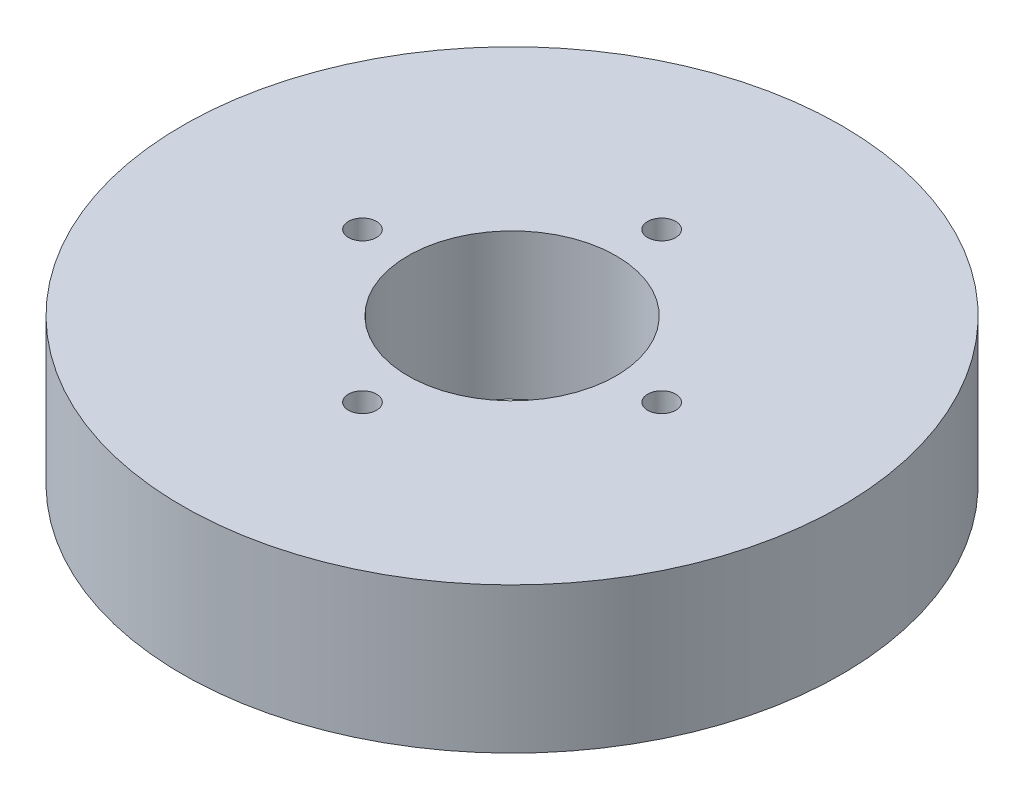
ISO-10303-21;
HEADER;
FILE_DESCRIPTION(('STEP AP214'),'2;1');
FILE_NAME('part.step','',(''),(''),'','','');
FILE_SCHEMA(('AUTOMOTIVE_DESIGN { 1 0 10303 214 1 1 1 1 }'));
ENDSEC;
DATA;
#1=APPLICATION_CONTEXT('core data for automotive mechanical design processes');
#2=APPLICATION_PROTOCOL_DEFINITION('international standard','automotive_design',2000,#1);
#3=PRODUCT_CONTEXT('',#1,'mechanical');
#4=PRODUCT('Part','Part','',(#3));
#5=PRODUCT_RELATED_PRODUCT_CATEGORY('part','',(#4));
#6=PRODUCT_DEFINITION_FORMATION('','',#4);
#7=PRODUCT_DEFINITION_CONTEXT('part definition',#1,'design');
#8=PRODUCT_DEFINITION('design','',#6,#7);
#9=PRODUCT_DEFINITION_SHAPE('','',#8);
#10=(LENGTH_UNIT() NAMED_UNIT(*) SI_UNIT(.MILLI.,.METRE.));
#11=(NAMED_UNIT(*) PLANE_ANGLE_UNIT() SI_UNIT($,.RADIAN.));
#12=(NAMED_UNIT(*) SI_UNIT($,.STERADIAN.) SOLID_ANGLE_UNIT());
#13=UNCERTAINTY_MEASURE_WITH_UNIT(LENGTH_MEASURE(1.E-05),#10,'distance_accuracy_value','');
#14=(GEOMETRIC_REPRESENTATION_CONTEXT(3) GLOBAL_UNCERTAINTY_ASSIGNED_CONTEXT((#13)) GLOBAL_UNIT_ASSIGNED_CONTEXT((#10,
#11,#12)) REPRESENTATION_CONTEXT('',''));
#15=CARTESIAN_POINT('',(0.,0.,0.));
#16=DIRECTION('',(0.,0.,1.));
#17=DIRECTION('',(1.,0.,0.));
#18=AXIS2_PLACEMENT_3D('',#15,#16,#17);
#19=CARTESIAN_POINT('',(0.,21.,0.));
#20=DIRECTION('',(0.,-1.,0.));
#21=DIRECTION('',(0.,0.,-1.));
#22=AXIS2_PLACEMENT_3D('',#19,#20,#21);
#23=CYLINDRICAL_SURFACE('',#22,47.5);
#24=CARTESIAN_POINT('',(0.,21.,0.));
#25=DIRECTION('',(0.,1.,0.));
#26=DIRECTION('',(0.,0.,1.));
#27=AXIS2_PLACEMENT_3D('',#24,#25,#26);
#28=CIRCLE('',#27,47.5);
#29=CARTESIAN_POINT('',(0.,21.,-47.5));
#30=VERTEX_POINT('',#29);
#31=EDGE_CURVE('E10',#30,#30,#28,.T.);
#32=CARTESIAN_POINT('',(0.,0.,0.));
#33=DIRECTION('',(0.,1.,0.));
#34=DIRECTION('',(0.,0.,1.));
#35=AXIS2_PLACEMENT_3D('',#32,#33,#34);
#36=CIRCLE('',#35,47.5);
#37=CARTESIAN_POINT('',(0.,0.,-47.5));
#38=VERTEX_POINT('',#37);
#39=EDGE_CURVE('E37',#38,#38,#36,.T.);
#40=CARTESIAN_POINT('',(0.,21.,-47.5));
#41=CARTESIAN_POINT('',(0.,20.78125,-47.5));
#42=CARTESIAN_POINT('',(0.,20.5625,-47.5));
#43=CARTESIAN_POINT('',(0.,20.125,-47.5));
#44=CARTESIAN_POINT('',(0.,19.90625,-47.5));
#45=CARTESIAN_POINT('',(0.,19.46875,-47.5));
#46=CARTESIAN_POINT('',(0.,19.25,-47.5));
#47=CARTESIAN_POINT('',(0.,18.8125,-47.5));
#48=CARTESIAN_POINT('',(0.,18.59375,-47.5));
#49=CARTESIAN_POINT('',(0.,18.15625,-47.5));
#50=CARTESIAN_POINT('',(0.,17.9375,-47.5));
#51=CARTESIAN_POINT('',(0.,17.5,-47.5));
#52=CARTESIAN_POINT('',(0.,17.28125,-47.5));
#53=CARTESIAN_POINT('',(0.,16.84375,-47.5));
#54=CARTESIAN_POINT('',(0.,16.625,-47.5));
#55=CARTESIAN_POINT('',(0.,16.1875,-47.5));
#56=CARTESIAN_POINT('',(0.,15.96875,-47.5));
#57=CARTESIAN_POINT('',(0.,15.53125,-47.5));
#58=CARTESIAN_POINT('',(0.,15.3125,-47.5));
#59=CARTESIAN_POINT('',(0.,14.875,-47.5));
#60=CARTESIAN_POINT('',(0.,14.65625,-47.5));
#61=CARTESIAN_POINT('',(0.,14.21875,-47.5));
#62=CARTESIAN_POINT('',(0.,14.,-47.5));
#63=CARTESIAN_POINT('',(0.,13.5625,-47.5));
#64=CARTESIAN_POINT('',(0.,13.34375,-47.5));
#65=CARTESIAN_POINT('',(0.,12.90625,-47.5));
#66=CARTESIAN_POINT('',(0.,12.6875,-47.5));
#67=CARTESIAN_POINT('',(0.,12.25,-47.5));
#68=CARTESIAN_POINT('',(0.,12.03125,-47.5));
#69=CARTESIAN_POINT('',(0.,11.59375,-47.5));
#70=CARTESIAN_POINT('',(0.,11.375,-47.5));
#71=CARTESIAN_POINT('',(0.,10.9375,-47.5));
#72=CARTESIAN_POINT('',(0.,10.71875,-47.5));
#73=CARTESIAN_POINT('',(0.,10.28125,-47.5));
#74=CARTESIAN_POINT('',(0.,10.0625,-47.5));
#75=CARTESIAN_POINT('',(0.,9.625,-47.5));
#76=CARTESIAN_POINT('',(0.,9.40625,-47.5));
#77=CARTESIAN_POINT('',(0.,8.96875,-47.5));
#78=CARTESIAN_POINT('',(0.,8.75,-47.5));
#79=CARTESIAN_POINT('',(0.,8.3125,-47.5));
#80=CARTESIAN_POINT('',(0.,8.09375,-47.5));
#81=CARTESIAN_POINT('',(0.,7.65625,-47.5));
#82=CARTESIAN_POINT('',(0.,7.4375,-47.5));
#83=CARTESIAN_POINT('',(0.,7.,-47.5));
#84=CARTESIAN_POINT('',(0.,6.78125,-47.5));
#85=CARTESIAN_POINT('',(0.,6.34375,-47.5));
#86=CARTESIAN_POINT('',(0.,6.125,-47.5));
#87=CARTESIAN_POINT('',(0.,5.6875,-47.5));
#88=CARTESIAN_POINT('',(0.,5.46875,-47.5));
#89=CARTESIAN_POINT('',(0.,5.03125,-47.5));
#90=CARTESIAN_POINT('',(0.,4.8125,-47.5));
#91=CARTESIAN_POINT('',(0.,4.375,-47.5));
#92=CARTESIAN_POINT('',(0.,4.15625,-47.5));
#93=CARTESIAN_POINT('',(0.,3.71875,-47.5));
#94=CARTESIAN_POINT('',(0.,3.5,-47.5));
#95=CARTESIAN_POINT('',(0.,3.0625,-47.5));
#96=CARTESIAN_POINT('',(0.,2.84375,-47.5));
#97=CARTESIAN_POINT('',(0.,2.40625,-47.5));
#98=CARTESIAN_POINT('',(0.,2.1875,-47.5));
#99=CARTESIAN_POINT('',(0.,1.75,-47.5));
#100=CARTESIAN_POINT('',(0.,1.53125,-47.5));
#101=CARTESIAN_POINT('',(0.,1.09375,-47.5));
#102=CARTESIAN_POINT('',(0.,0.875000000000001,-47.5));
#103=CARTESIAN_POINT('',(0.,0.4375,-47.5));
#104=CARTESIAN_POINT('',(0.,0.21875,-47.5));
#105=CARTESIAN_POINT('',(0.,0.,-47.5));
#106=B_SPLINE_CURVE_WITH_KNOTS('',3,(#40,#41,#42,#43,#44,#45,#46,#47,#48,#49,#50,#51,#52,#53,
#54,#55,#56,#57,#58,#59,#60,#61,#62,#63,#64,#65,#66,#67,#68,#69,#70,#71,#72,#73,#74,#75,#76,#77,
#78,#79,#80,#81,#82,#83,#84,#85,#86,#87,#88,#89,#90,#91,#92,#93,#94,#95,#96,#97,#98,#99,#100,
#101,#102,#103,#104,#105),.UNSPECIFIED.,.F.,.F.,(4,2,2,2,2,2,2,2,2,2,2,2,2,2,2,2,2,2,2,2,2,2,2,
2,2,2,2,2,2,2,2,2,4),(0.,0.656249999999997,1.3125,1.96875,2.625,3.28125,3.9375,4.59375,5.25,
5.90625,6.5625,7.21875,7.875,8.53125,9.1875,9.84375,10.5,11.15625,11.8125,12.46875,13.125,
13.78125,14.4375,15.09375,15.75,16.40625,17.0625,17.71875,18.375,19.03125,19.6875,20.34375,21.),.UNSPECIFIED.);
#107=EDGE_CURVE('BSEAM40',#30,#38,#106,.T.);
#108=ORIENTED_EDGE('',*,*,#31,.F.);
#109=ORIENTED_EDGE('',*,*,#39,.T.);
#110=ORIENTED_EDGE('',*,*,#107,.T.);
#111=ORIENTED_EDGE('',*,*,#107,.F.);
#112=EDGE_LOOP('',(#108,#110,#109,#111));
#113=FACE_BOUND('',#112,.T.);
#114=ADVANCED_FACE('F40',(#113),#23,.T.);
#115=CARTESIAN_POINT('',(0.,21.,0.));
#116=DIRECTION('',(0.,1.,0.));
#117=DIRECTION('',(0.,0.,1.));
#118=AXIS2_PLACEMENT_3D('',#115,#116,#117);
#119=PLANE('',#118);
#120=CARTESIAN_POINT('',(0.,21.,21.5611266038576));
#121=DIRECTION('',(0.,1.,0.));
#122=DIRECTION('',(1.,0.,0.));
#123=AXIS2_PLACEMENT_3D('',#120,#121,#122);
#124=CIRCLE('',#123,2.02263603072415);
#125=CARTESIAN_POINT('',(2.02263603072422,21.,21.5611266038576));
#126=VERTEX_POINT('',#125);
#127=EDGE_CURVE('E71',#126,#126,#124,.T.);
#128=ORIENTED_EDGE('',*,*,#127,.F.);
#129=EDGE_LOOP('',(#128));
#130=FACE_BOUND('',#129,.T.);
#131=CARTESIAN_POINT('',(21.5611266038576,21.,0.));
#132=DIRECTION('',(0.,1.,0.));
#133=DIRECTION('',(0.,0.,-1.));
#134=AXIS2_PLACEMENT_3D('',#131,#132,#133);
#135=CIRCLE('',#134,2.02263603072415);
#136=CARTESIAN_POINT('',(21.5611266038576,21.,-2.02263603072415));
#137=VERTEX_POINT('',#136);
#138=EDGE_CURVE('E70',#137,#137,#135,.T.);
#139=ORIENTED_EDGE('',*,*,#138,.F.);
#140=EDGE_LOOP('',(#139));
#141=FACE_BOUND('',#140,.T.);
#142=CARTESIAN_POINT('',(-2.25840813545409E-13,21.,-21.5611266038576));
#143=DIRECTION('',(0.,1.,0.));
#144=DIRECTION('',(-1.,0.,0.));
#145=AXIS2_PLACEMENT_3D('',#142,#143,#144);
#146=CIRCLE('',#145,2.02263603072415);
#147=CARTESIAN_POINT('',(-2.02263603072438,21.,-21.5611266038576));
#148=VERTEX_POINT('',#147);
#149=EDGE_CURVE('E61',#148,#148,#146,.T.);
#150=ORIENTED_EDGE('',*,*,#149,.F.);
#151=EDGE_LOOP('',(#150));
#152=FACE_BOUND('',#151,.T.);
#153=CARTESIAN_POINT('',(-21.5611266038576,21.,0.));
#154=DIRECTION('',(0.,1.,0.));
#155=DIRECTION('',(0.,0.,1.));
#156=AXIS2_PLACEMENT_3D('',#153,#154,#155);
#157=CIRCLE('',#156,2.02263603072415);
#158=CARTESIAN_POINT('',(-21.5611266038576,21.,2.02263603072415));
#159=VERTEX_POINT('',#158);
#160=EDGE_CURVE('E54',#159,#159,#157,.T.);
#161=ORIENTED_EDGE('',*,*,#160,.F.);
#162=EDGE_LOOP('',(#161));
#163=FACE_BOUND('',#162,.T.);
#164=CARTESIAN_POINT('',(0.,21.,0.));
#165=DIRECTION('',(0.,1.,0.));
#166=DIRECTION('',(0.,0.,1.));
#167=AXIS2_PLACEMENT_3D('',#164,#165,#166);
#168=CIRCLE('',#167,15.);
#169=CARTESIAN_POINT('',(0.,21.,-15.));
#170=VERTEX_POINT('',#169);
#171=EDGE_CURVE('E50',#170,#170,#168,.T.);
#172=ORIENTED_EDGE('',*,*,#171,.F.);
#173=EDGE_LOOP('',(#172));
#174=FACE_BOUND('',#173,.T.);
#175=ORIENTED_EDGE('',*,*,#31,.T.);
#176=EDGE_LOOP('',(#175));
#177=FACE_BOUND('',#176,.T.);
#178=ADVANCED_FACE('F86',(#130,#141,#152,#163,#174,#177),#119,.T.);
#179=CARTESIAN_POINT('',(0.,0.,0.));
#180=DIRECTION('',(0.,1.,0.));
#181=DIRECTION('',(0.,0.,1.));
#182=AXIS2_PLACEMENT_3D('',#179,#180,#181);
#183=PLANE('',#182);
#184=CARTESIAN_POINT('',(0.,0.,0.));
#185=DIRECTION('',(0.,1.,0.));
#186=DIRECTION('',(0.,0.,1.));
#187=AXIS2_PLACEMENT_3D('',#184,#185,#186);
#188=CIRCLE('',#187,15.);
#189=CARTESIAN_POINT('',(0.,0.,-15.));
#190=VERTEX_POINT('',#189);
#191=EDGE_CURVE('E47',#190,#190,#188,.T.);
#192=ORIENTED_EDGE('',*,*,#191,.T.);
#193=EDGE_LOOP('',(#192));
#194=FACE_BOUND('',#193,.T.);
#195=ORIENTED_EDGE('',*,*,#39,.F.);
#196=EDGE_LOOP('',(#195));
#197=FACE_BOUND('',#196,.T.);
#198=ADVANCED_FACE('F93',(#194,#197),#183,.F.);
#199=CARTESIAN_POINT('',(0.,21.,0.));
#200=DIRECTION('',(0.,-1.,0.));
#201=DIRECTION('',(0.,0.,-1.));
#202=AXIS2_PLACEMENT_3D('',#199,#200,#201);
#203=CYLINDRICAL_SURFACE('',#202,15.);
#204=CARTESIAN_POINT('',(0.,21.,-15.));
#205=CARTESIAN_POINT('',(0.,20.78125,-15.));
#206=CARTESIAN_POINT('',(0.,20.5625,-15.));
#207=CARTESIAN_POINT('',(0.,20.125,-15.));
#208=CARTESIAN_POINT('',(0.,19.90625,-15.));
#209=CARTESIAN_POINT('',(0.,19.46875,-15.));
#210=CARTESIAN_POINT('',(0.,19.25,-15.));
#211=CARTESIAN_POINT('',(0.,18.8125,-15.));
#212=CARTESIAN_POINT('',(0.,18.59375,-15.));
#213=CARTESIAN_POINT('',(0.,18.15625,-15.));
#214=CARTESIAN_POINT('',(0.,17.9375,-15.));
#215=CARTESIAN_POINT('',(0.,17.5,-15.));
#216=CARTESIAN_POINT('',(0.,17.28125,-15.));
#217=CARTESIAN_POINT('',(0.,16.84375,-15.));
#218=CARTESIAN_POINT('',(0.,16.625,-15.));
#219=CARTESIAN_POINT('',(0.,16.1875,-15.));
#220=CARTESIAN_POINT('',(0.,15.96875,-15.));
#221=CARTESIAN_POINT('',(0.,15.53125,-15.));
#222=CARTESIAN_POINT('',(0.,15.3125,-15.));
#223=CARTESIAN_POINT('',(0.,14.875,-15.));
#224=CARTESIAN_POINT('',(0.,14.65625,-15.));
#225=CARTESIAN_POINT('',(0.,14.21875,-15.));
#226=CARTESIAN_POINT('',(0.,14.,-15.));
#227=CARTESIAN_POINT('',(0.,13.5625,-15.));
#228=CARTESIAN_POINT('',(0.,13.34375,-15.));
#229=CARTESIAN_POINT('',(0.,12.90625,-15.));
#230=CARTESIAN_POINT('',(0.,12.6875,-15.));
#231=CARTESIAN_POINT('',(0.,12.25,-15.));
#232=CARTESIAN_POINT('',(0.,12.03125,-15.));
#233=CARTESIAN_POINT('',(0.,11.59375,-15.));
#234=CARTESIAN_POINT('',(0.,11.375,-15.));
#235=CARTESIAN_POINT('',(0.,10.9375,-15.));
#236=CARTESIAN_POINT('',(0.,10.71875,-15.));
#237=CARTESIAN_POINT('',(0.,10.28125,-15.));
#238=CARTESIAN_POINT('',(0.,10.0625,-15.));
#239=CARTESIAN_POINT('',(0.,9.625,-15.));
#240=CARTESIAN_POINT('',(0.,9.40625,-15.));
#241=CARTESIAN_POINT('',(0.,8.96875,-15.));
#242=CARTESIAN_POINT('',(0.,8.75,-15.));
#243=CARTESIAN_POINT('',(0.,8.3125,-15.));
#244=CARTESIAN_POINT('',(0.,8.09375,-15.));
#245=CARTESIAN_POINT('',(0.,7.65625,-15.));
#246=CARTESIAN_POINT('',(0.,7.4375,-15.));
#247=CARTESIAN_POINT('',(0.,7.,-15.));
#248=CARTESIAN_POINT('',(0.,6.78125,-15.));
#249=CARTESIAN_POINT('',(0.,6.34375,-15.));
#250=CARTESIAN_POINT('',(0.,6.125,-15.));
#251=CARTESIAN_POINT('',(0.,5.6875,-15.));
#252=CARTESIAN_POINT('',(0.,5.46875,-15.));
#253=CARTESIAN_POINT('',(0.,5.03125,-15.));
#254=CARTESIAN_POINT('',(0.,4.8125,-15.));
#255=CARTESIAN_POINT('',(0.,4.375,-15.));
#256=CARTESIAN_POINT('',(0.,4.15625,-15.));
#257=CARTESIAN_POINT('',(0.,3.71875,-15.));
#258=CARTESIAN_POINT('',(0.,3.5,-15.));
#259=CARTESIAN_POINT('',(0.,3.0625,-15.));
#260=CARTESIAN_POINT('',(0.,2.84375,-15.));
#261=CARTESIAN_POINT('',(0.,2.40625,-15.));
#262=CARTESIAN_POINT('',(0.,2.1875,-15.));
#263=CARTESIAN_POINT('',(0.,1.75,-15.));
#264=CARTESIAN_POINT('',(0.,1.53125,-15.));
#265=CARTESIAN_POINT('',(0.,1.09375,-15.));
#266=CARTESIAN_POINT('',(0.,0.875000000000001,-15.));
#267=CARTESIAN_POINT('',(0.,0.4375,-15.));
#268=CARTESIAN_POINT('',(0.,0.21875,-15.));
#269=CARTESIAN_POINT('',(0.,0.,-15.));
#270=B_SPLINE_CURVE_WITH_KNOTS('',3,(#204,#205,#206,#207,#208,#209,#210,#211,#212,#213,#214,
#215,#216,#217,#218,#219,#220,#221,#222,#223,#224,#225,#226,#227,#228,#229,#230,#231,#232,#233,
#234,#235,#236,#237,#238,#239,#240,#241,#242,#243,#244,#245,#246,#247,#248,#249,#250,#251,#252,
#253,#254,#255,#256,#257,#258,#259,#260,#261,#262,#263,#264,#265,#266,#267,#268,#269),
.UNSPECIFIED.,.F.,.F.,(4,2,2,2,2,2,2,2,2,2,2,2,2,2,2,2,2,2,2,2,2,2,2,2,2,2,2,2,2,2,2,2,4),(0.,
0.656250000000001,1.3125,1.96875,2.625,3.28125,3.9375,4.59375,5.25,5.90625,6.5625,7.21875,7.875,
8.53125,9.1875,9.84375,10.5,11.15625,11.8125,12.46875,13.125,13.78125,14.4375,15.09375,15.75,
16.40625,17.0625,17.71875,18.375,19.03125,19.6875,20.34375,21.),.UNSPECIFIED.);
#271=EDGE_CURVE('BSEAM101',#170,#190,#270,.T.);
#272=ORIENTED_EDGE('',*,*,#171,.T.);
#273=ORIENTED_EDGE('',*,*,#191,.F.);
#274=ORIENTED_EDGE('',*,*,#271,.T.);
#275=ORIENTED_EDGE('',*,*,#271,.F.);
#276=EDGE_LOOP('',(#272,#274,#273,#275));
#277=FACE_BOUND('',#276,.T.);
#278=ADVANCED_FACE('F101',(#277),#203,.F.);
#279=CARTESIAN_POINT('',(-21.5611266038576,1.78547314871477,0.));
#280=DIRECTION('',(0.,1.,0.));
#281=DIRECTION('',(0.,0.,1.));
#282=AXIS2_PLACEMENT_3D('',#279,#280,#281);
#283=CYLINDRICAL_SURFACE('',#282,2.02263603072415);
#284=CARTESIAN_POINT('',(-21.5611266038576,1.78547314871477,0.));
#285=DIRECTION('',(0.,1.,0.));
#286=DIRECTION('',(0.,0.,1.));
#287=AXIS2_PLACEMENT_3D('',#284,#285,#286);
#288=CIRCLE('',#287,2.02263603072415);
#289=CARTESIAN_POINT('',(-21.5611266038576,1.78547314871477,2.02263603072415));
#290=VERTEX_POINT('',#289);
#291=EDGE_CURVE('E55',#290,#290,#288,.T.);
#292=ORIENTED_EDGE('',*,*,#291,.F.);
#293=EDGE_LOOP('',(#292));
#294=FACE_BOUND('',#293,.T.);
#295=ORIENTED_EDGE('',*,*,#160,.T.);
#296=EDGE_LOOP('',(#295));
#297=FACE_BOUND('',#296,.T.);
#298=ADVANCED_FACE('F102',(#294,#297),#283,.F.);
#299=CARTESIAN_POINT('',(-21.5611266038576,1.78547314871477,0.));
#300=DIRECTION('',(0.,1.,0.));
#301=DIRECTION('',(0.,0.,1.));
#302=AXIS2_PLACEMENT_3D('',#299,#300,#301);
#303=PLANE('',#302);
#304=ORIENTED_EDGE('',*,*,#291,.T.);
#305=EDGE_LOOP('',(#304));
#306=FACE_BOUND('',#305,.T.);
#307=ADVANCED_FACE('F133',(#306),#303,.T.);
#308=CARTESIAN_POINT('',(-2.25840813545409E-13,1.78547314871477,-21.5611266038576));
#309=DIRECTION('',(0.,1.,0.));
#310=DIRECTION('',(0.,0.,1.));
#311=AXIS2_PLACEMENT_3D('',#308,#309,#310);
#312=CYLINDRICAL_SURFACE('',#311,2.02263603072415);
#313=CARTESIAN_POINT('',(-2.25840813545409E-13,1.78547314871477,-21.5611266038576));
#314=DIRECTION('',(0.,1.,0.));
#315=DIRECTION('',(-1.,0.,0.));
#316=AXIS2_PLACEMENT_3D('',#313,#314,#315);
#317=CIRCLE('',#316,2.02263603072415);
#318=CARTESIAN_POINT('',(-2.02263603072438,1.78547314871477,-21.5611266038576));
#319=VERTEX_POINT('',#318);
#320=EDGE_CURVE('E63',#319,#319,#317,.T.);
#321=ORIENTED_EDGE('',*,*,#320,.F.);
#322=EDGE_LOOP('',(#321));
#323=FACE_BOUND('',#322,.T.);
#324=ORIENTED_EDGE('',*,*,#149,.T.);
#325=EDGE_LOOP('',(#324));
#326=FACE_BOUND('',#325,.T.);
#327=ADVANCED_FACE('F142',(#323,#326),#312,.F.);
#328=CARTESIAN_POINT('',(-2.25840813545409E-13,1.78547314871477,-21.5611266038576));
#329=DIRECTION('',(0.,1.,0.));
#330=DIRECTION('',(-1.,0.,0.));
#331=AXIS2_PLACEMENT_3D('',#328,#329,#330);
#332=PLANE('',#331);
#333=ORIENTED_EDGE('',*,*,#320,.T.);
#334=EDGE_LOOP('',(#333));
#335=FACE_BOUND('',#334,.T.);
#336=ADVANCED_FACE('F156',(#335),#332,.T.);
#337=CARTESIAN_POINT('',(21.5611266038576,1.78547314871477,0.));
#338=DIRECTION('',(0.,1.,0.));
#339=DIRECTION('',(0.,0.,1.));
#340=AXIS2_PLACEMENT_3D('',#337,#338,#339);
#341=CYLINDRICAL_SURFACE('',#340,2.02263603072415);
#342=CARTESIAN_POINT('',(21.5611266038576,1.78547314871477,0.));
#343=DIRECTION('',(0.,1.,0.));
#344=DIRECTION('',(0.,0.,-1.));
#345=AXIS2_PLACEMENT_3D('',#342,#343,#344);
#346=CIRCLE('',#345,2.02263603072415);
#347=CARTESIAN_POINT('',(21.5611266038576,1.78547314871477,-2.02263603072415));
#348=VERTEX_POINT('',#347);
#349=EDGE_CURVE('E69',#348,#348,#346,.T.);
#350=ORIENTED_EDGE('',*,*,#349,.F.);
#351=EDGE_LOOP('',(#350));
#352=FACE_BOUND('',#351,.T.);
#353=ORIENTED_EDGE('',*,*,#138,.T.);
#354=EDGE_LOOP('',(#353));
#355=FACE_BOUND('',#354,.T.);
#356=ADVANCED_FACE('F164',(#352,#355),#341,.F.);
#357=CARTESIAN_POINT('',(21.5611266038576,1.78547314871477,0.));
#358=DIRECTION('',(0.,1.,0.));
#359=DIRECTION('',(0.,0.,-1.));
#360=AXIS2_PLACEMENT_3D('',#357,#358,#359);
#361=PLANE('',#360);
#362=ORIENTED_EDGE('',*,*,#349,.T.);
#363=EDGE_LOOP('',(#362));
#364=FACE_BOUND('',#363,.T.);
#365=ADVANCED_FACE('F83',(#364),#361,.T.);
#366=CARTESIAN_POINT('',(0.,1.78547314871477,21.5611266038576));
#367=DIRECTION('',(0.,1.,0.));
#368=DIRECTION('',(0.,0.,1.));
#369=AXIS2_PLACEMENT_3D('',#366,#367,#368);
#370=CYLINDRICAL_SURFACE('',#369,2.02263603072415);
#371=CARTESIAN_POINT('',(0.,1.78547314871477,21.5611266038576));
#372=DIRECTION('',(0.,1.,0.));
#373=DIRECTION('',(1.,0.,0.));
#374=AXIS2_PLACEMENT_3D('',#371,#372,#373);
#375=CIRCLE('',#374,2.02263603072415);
#376=CARTESIAN_POINT('',(2.02263603072422,1.78547314871477,21.5611266038576));
#377=VERTEX_POINT('',#376);
#378=EDGE_CURVE('E59',#377,#377,#375,.T.);
#379=ORIENTED_EDGE('',*,*,#378,.F.);
#380=EDGE_LOOP('',(#379));
#381=FACE_BOUND('',#380,.T.);
#382=ORIENTED_EDGE('',*,*,#127,.T.);
#383=EDGE_LOOP('',(#382));
#384=FACE_BOUND('',#383,.T.);
#385=ADVANCED_FACE('F81',(#381,#384),#370,.F.);
#386=CARTESIAN_POINT('',(0.,1.78547314871477,21.5611266038576));
#387=DIRECTION('',(0.,1.,0.));
#388=DIRECTION('',(1.,0.,0.));
#389=AXIS2_PLACEMENT_3D('',#386,#387,#388);
#390=PLANE('',#389);
#391=ORIENTED_EDGE('',*,*,#378,.T.);
#392=EDGE_LOOP('',(#391));
#393=FACE_BOUND('',#392,.T.);
#394=ADVANCED_FACE('F78',(#393),#390,.T.);
#395=CLOSED_SHELL('',(#114,#178,#198,#278,#298,#307,#327,#336,#356,#365,#385,#394));
#396=MANIFOLD_SOLID_BREP('B2',#395);
#397=ADVANCED_BREP_SHAPE_REPRESENTATION('',(#18,#396),#14);
#398=SHAPE_DEFINITION_REPRESENTATION(#9,#397);
ENDSEC;
END-ISO-10303-21;
